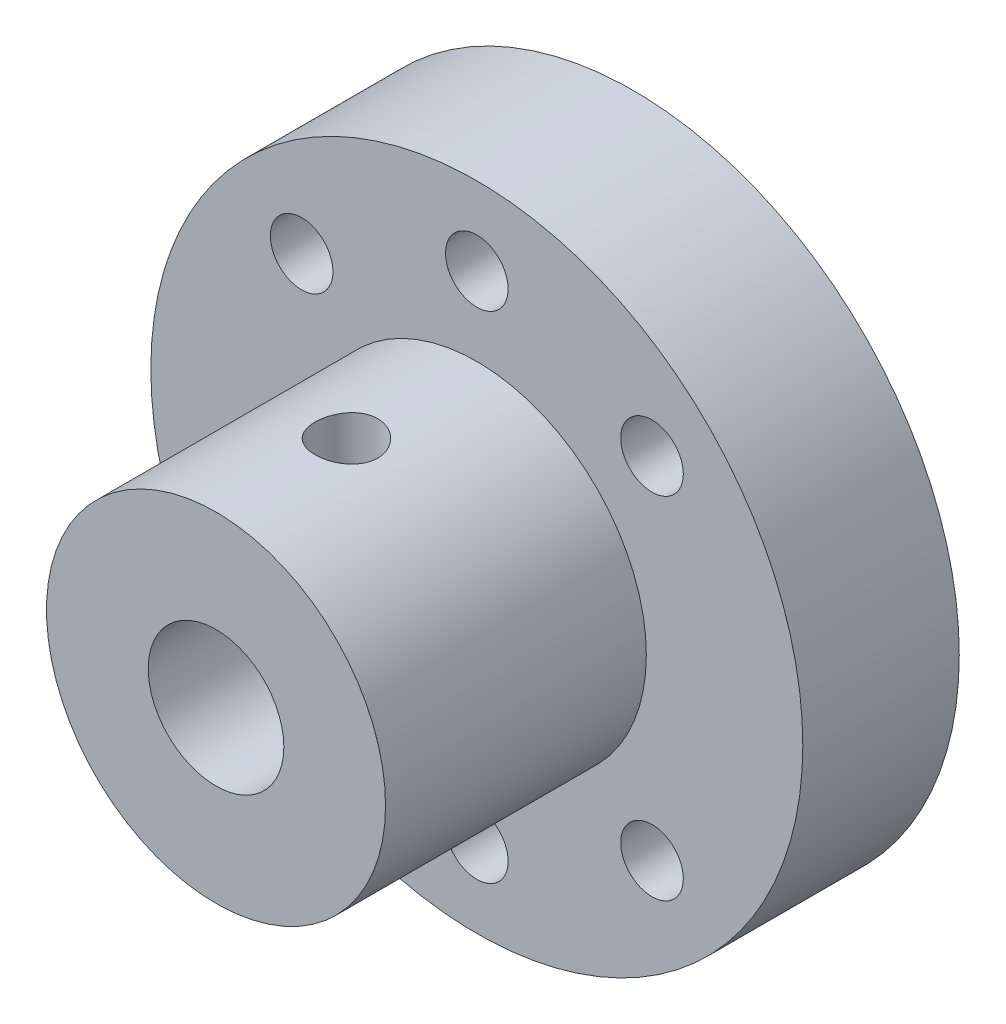
ISO-10303-21;
HEADER;
FILE_DESCRIPTION(('STEP AP214'),'2;1');
FILE_NAME('part.step','',(''),(''),'','','');
FILE_SCHEMA(('AUTOMOTIVE_DESIGN { 1 0 10303 214 1 1 1 1 }'));
ENDSEC;
DATA;
#1=APPLICATION_CONTEXT('core data for automotive mechanical design processes');
#2=APPLICATION_PROTOCOL_DEFINITION('international standard','automotive_design',2000,#1);
#3=PRODUCT_CONTEXT('',#1,'mechanical');
#4=PRODUCT('Part','Part','',(#3));
#5=PRODUCT_RELATED_PRODUCT_CATEGORY('part','',(#4));
#6=PRODUCT_DEFINITION_FORMATION('','',#4);
#7=PRODUCT_DEFINITION_CONTEXT('part definition',#1,'design');
#8=PRODUCT_DEFINITION('design','',#6,#7);
#9=PRODUCT_DEFINITION_SHAPE('','',#8);
#10=(LENGTH_UNIT() NAMED_UNIT(*) SI_UNIT(.MILLI.,.METRE.));
#11=(NAMED_UNIT(*) PLANE_ANGLE_UNIT() SI_UNIT($,.RADIAN.));
#12=(NAMED_UNIT(*) SI_UNIT($,.STERADIAN.) SOLID_ANGLE_UNIT());
#13=UNCERTAINTY_MEASURE_WITH_UNIT(LENGTH_MEASURE(1.E-05),#10,'distance_accuracy_value','');
#14=(GEOMETRIC_REPRESENTATION_CONTEXT(3) GLOBAL_UNCERTAINTY_ASSIGNED_CONTEXT((#13)) GLOBAL_UNIT_ASSIGNED_CONTEXT((#10,
#11,#12)) REPRESENTATION_CONTEXT('',''));
#15=CARTESIAN_POINT('',(0.,0.,0.));
#16=DIRECTION('',(0.,0.,1.));
#17=DIRECTION('',(1.,0.,0.));
#18=AXIS2_PLACEMENT_3D('',#15,#16,#17);
#19=CARTESIAN_POINT('',(0.,25.,11.));
#20=DIRECTION('',(0.,-1.,0.));
#21=DIRECTION('',(0.,0.,-1.));
#22=AXIS2_PLACEMENT_3D('',#19,#20,#21);
#23=CYLINDRICAL_SURFACE('',#22,1.2);
#24=CARTESIAN_POINT('',(0.,-6.5,9.8));
#25=CARTESIAN_POINT('',(0.0667962993626081,-6.49999879727572,9.80000257211707));
#26=CARTESIAN_POINT('',(0.133626281673587,-6.49895972178335,9.80559602783191));
#27=CARTESIAN_POINT('',(0.265404300030401,-6.49491478174011,9.82780839939203));
#28=CARTESIAN_POINT('',(0.330350677512255,-6.49190723570874,9.84443674147905));
#29=CARTESIAN_POINT('',(0.456436519782736,-6.48426191804226,9.88819343614065));
#30=CARTESIAN_POINT('',(0.517579319792998,-6.47962559903149,9.91531243477524));
#31=CARTESIAN_POINT('',(0.634441109694969,-6.46922952137734,9.97925437230046));
#32=CARTESIAN_POINT('',(0.690160564109867,-6.46346985907829,10.0160764790921));
#33=CARTESIAN_POINT('',(0.795247744205698,-6.45138834939994,10.0988339655751));
#34=CARTESIAN_POINT('',(0.844543292388614,-6.44506127279023,10.1448602438627));
#35=CARTESIAN_POINT('',(0.934759066401608,-6.43259702053078,10.2445239993348));
#36=CARTESIAN_POINT('',(0.975678701684754,-6.42645985829691,10.2981620127366));
#37=CARTESIAN_POINT('',(1.04827972317034,-6.41501951319584,10.4120346888511));
#38=CARTESIAN_POINT('',(1.07988798202191,-6.40972307507926,10.4723167120454));
#39=CARTESIAN_POINT('',(1.13250094978906,-6.40063738902812,10.5974493310561));
#40=CARTESIAN_POINT('',(1.15350654396689,-6.39684801526784,10.6622995449391));
#41=CARTESIAN_POINT('',(1.18408687284635,-6.39125806003697,10.7939563964509));
#42=CARTESIAN_POINT('',(1.19378730462821,-6.38943562620813,10.8607328919666));
#43=CARTESIAN_POINT('',(1.20187204389847,-6.38791998048299,10.9949886066854));
#44=CARTESIAN_POINT('',(1.20025733484479,-6.38822658354097,11.0624677643074));
#45=CARTESIAN_POINT('',(1.18585961873334,-6.39091446543458,11.1953046129655));
#46=CARTESIAN_POINT('',(1.17321929073711,-6.39326923845306,11.2606783838624));
#47=CARTESIAN_POINT('',(1.13735373323502,-6.39974652439446,11.3883611380003));
#48=CARTESIAN_POINT('',(1.11412806641468,-6.40386911035101,11.4506699945019));
#49=CARTESIAN_POINT('',(1.05761084900825,-6.41344535336497,11.5708730718194));
#50=CARTESIAN_POINT('',(1.0242614500129,-6.41890662438299,11.6287394617883));
#51=CARTESIAN_POINT('',(0.948484370023446,-6.43053982016241,11.7381087118248));
#52=CARTESIAN_POINT('',(0.906055794920213,-6.43671181488758,11.7896109443674));
#53=CARTESIAN_POINT('',(0.812554310960554,-6.44918666593044,11.8856145088169));
#54=CARTESIAN_POINT('',(0.761359307961523,-6.45549008145401,11.9299969416265));
#55=CARTESIAN_POINT('',(0.652187389345436,-6.46743086297198,12.0095611870548));
#56=CARTESIAN_POINT('',(0.594210409619175,-6.47306822266922,12.0447429126901));
#57=CARTESIAN_POINT('',(0.472998043002823,-6.48305257458405,12.1049236018053));
#58=CARTESIAN_POINT('',(0.409756516582691,-6.48739803241448,12.1299104698962));
#59=CARTESIAN_POINT('',(0.279875838888337,-6.49429705012122,12.1688733856488));
#60=CARTESIAN_POINT('',(0.213237038103507,-6.49685079444502,12.1828505667182));
#61=CARTESIAN_POINT('',(0.0794766430718829,-6.49985338930874,12.1992324791651));
#62=CARTESIAN_POINT('',(0.0123756497053713,-6.50033187707818,12.2018001653558));
#63=CARTESIAN_POINT('',(-0.121296981962713,-6.49921181273706,12.1957269238374));
#64=CARTESIAN_POINT('',(-0.187868645294989,-6.49761335943468,12.1870865293404));
#65=CARTESIAN_POINT('',(-0.318077984755796,-6.49253745576473,12.1589778880872));
#66=CARTESIAN_POINT('',(-0.381734009693139,-6.48907427500552,12.1395918384477));
#67=CARTESIAN_POINT('',(-0.504892375398316,-6.4806556240529,12.0906309426582));
#68=CARTESIAN_POINT('',(-0.564394440600634,-6.47570005497306,12.0610554213297));
#69=CARTESIAN_POINT('',(-0.678253095830679,-6.4647724074758,11.9921926389773));
#70=CARTESIAN_POINT('',(-0.732548265605505,-6.45879008348503,11.9528054836735));
#71=CARTESIAN_POINT('',(-0.833816870545852,-6.44649953986676,11.8655729863892));
#72=CARTESIAN_POINT('',(-0.880789643607566,-6.44019129083715,11.8177268803695));
#73=CARTESIAN_POINT('',(-0.966697085412809,-6.42786191143313,11.7141978916263));
#74=CARTESIAN_POINT('',(-1.00552070246097,-6.42184551244879,11.6584222026507));
#75=CARTESIAN_POINT('',(-1.07324774919417,-6.41087523291019,11.5410450642831));
#76=CARTESIAN_POINT('',(-1.10215154047974,-6.40592131362856,11.4794438273501));
#77=CARTESIAN_POINT('',(-1.14905975241548,-6.39767379439307,11.3524502912698));
#78=CARTESIAN_POINT('',(-1.16711570494917,-6.39437235713613,11.2870775593624));
#79=CARTESIAN_POINT('',(-1.19197513111159,-6.38978543443045,11.1541598228393));
#80=CARTESIAN_POINT('',(-1.19877983115992,-6.38849972926177,11.0866150558001));
#81=CARTESIAN_POINT('',(-1.20090353537778,-6.3881007482456,10.9523824427173));
#82=CARTESIAN_POINT('',(-1.19639765292492,-6.38895435075601,10.8856974024697));
#83=CARTESIAN_POINT('',(-1.17641079397786,-6.39266448585662,10.7540525811393));
#84=CARTESIAN_POINT('',(-1.16092987834811,-6.39552100733921,10.6890927904909));
#85=CARTESIAN_POINT('',(-1.11950532017773,-6.40290136886896,10.5628328037374));
#86=CARTESIAN_POINT('',(-1.09358007946632,-6.40742227523992,10.5015263877117));
#87=CARTESIAN_POINT('',(-1.032021760182,-6.41762418955728,10.3841052623261));
#88=CARTESIAN_POINT('',(-0.996388024820644,-6.42330527598439,10.3279909045579));
#89=CARTESIAN_POINT('',(-0.915813071798076,-6.43529057182139,10.2216684838111));
#90=CARTESIAN_POINT('',(-0.870744203302653,-6.44160263227606,10.1715580280314));
#91=CARTESIAN_POINT('',(-0.772845002820406,-6.45407937835197,10.0795524609866));
#92=CARTESIAN_POINT('',(-0.720012889705215,-6.46024402977463,10.0376592401731));
#93=CARTESIAN_POINT('',(-0.607537484977905,-6.47179409996219,9.96293825948846));
#94=CARTESIAN_POINT('',(-0.547839004017674,-6.47717228318667,9.93019242527087));
#95=CARTESIAN_POINT('',(-0.42370854944922,-6.48647285935735,9.87524717130095));
#96=CARTESIAN_POINT('',(-0.3592811283988,-6.49039663100581,9.85303775798059));
#97=CARTESIAN_POINT('',(-0.245545866371185,-6.49553807584249,9.82435080717887));
#98=CARTESIAN_POINT('',(-0.196906528350574,-6.49720192234607,9.81523471554345));
#99=CARTESIAN_POINT('',(-0.0988509306569767,-6.49943331626516,9.80305843317357));
#100=CARTESIAN_POINT('',(-0.0494346897454305,-6.50000089011371,9.79999809642434));
#101=CARTESIAN_POINT('',(0.,-6.5,9.8));
#102=B_SPLINE_CURVE_WITH_KNOTS('',3,(#24,#25,#26,#27,#28,#29,#30,#31,#32,#33,#34,#35,#36,#37,
#38,#39,#40,#41,#42,#43,#44,#45,#46,#47,#48,#49,#50,#51,#52,#53,#54,#55,#56,#57,#58,#59,#60,#61,
#62,#63,#64,#65,#66,#67,#68,#69,#70,#71,#72,#73,#74,#75,#76,#77,#78,#79,#80,#81,#82,#83,#84,#85,
#86,#87,#88,#89,#90,#91,#92,#93,#94,#95,#96,#97,#98,#99,#100,#101),.UNSPECIFIED.,.T.,.F.,(4,2,2,
2,2,2,2,2,2,2,2,2,2,2,2,2,2,2,2,2,2,2,2,2,2,2,2,2,2,2,2,2,2,2,2,2,2,2,4),(0.,0.200208125257265,
0.400587493204053,0.600788604213541,0.800972552376601,1.00324088953467,1.20552348279051,
1.40935476877731,1.61316903319364,1.81469487992138,2.01620321120369,2.21514193787252,
2.41408888408644,2.61419475105378,2.81432033334393,3.01750151628567,3.2206846200298,
3.42410808829514,3.6275106121083,3.8279985269071,4.02847690406412,4.22744250539259,
4.42642129319003,4.62751523490318,4.8286273493452,5.03232388047527,5.23601298560803,
5.43872666786995,5.64141825228765,5.84099112816951,6.04056289728494,6.23978456857919,
6.43901972074741,6.64114822168658,6.84332316977221,7.04725467103853,7.25099235904023,
7.39916621446434,7.54733649711547),.UNSPECIFIED.);
#103=CARTESIAN_POINT('',(0.,-6.5,9.8));
#104=VERTEX_POINT('',#103);
#105=EDGE_CURVE('E99',#104,#104,#102,.T.);
#106=ORIENTED_EDGE('',*,*,#105,.T.);
#107=EDGE_LOOP('',(#106));
#108=FACE_BOUND('',#107,.T.);
#109=CARTESIAN_POINT('',(0.,-2.6,9.8));
#110=CARTESIAN_POINT('',(-0.0636532268816322,-2.59999718597822,9.80000336998323));
#111=CARTESIAN_POINT('',(-0.127399042201598,-2.59763662818433,9.80509450777092));
#112=CARTESIAN_POINT('',(-0.253042141169717,-2.58842783188776,9.82525054494741));
#113=CARTESIAN_POINT('',(-0.31493491548471,-2.58156945057963,9.8403379872699));
#114=CARTESIAN_POINT('',(-0.434856989321515,-2.5640900937612,9.87979092873397));
#115=CARTESIAN_POINT('',(-0.492899567661716,-2.55348294499246,9.90412235728243));
#116=CARTESIAN_POINT('',(-0.604009204690612,-2.52950742914898,9.96121346683976));
#117=CARTESIAN_POINT('',(-0.657077164281334,-2.51613956344932,9.99397161773264));
#118=CARTESIAN_POINT('',(-0.759947590922261,-2.48706428400778,10.0690069633604));
#119=CARTESIAN_POINT('',(-0.809420678774752,-2.47126968566342,10.1117015287035));
#120=CARTESIAN_POINT('',(-0.900798998405768,-2.43944804820435,10.2045085021185));
#121=CARTESIAN_POINT('',(-0.942699360382197,-2.4234208666271,10.2546256460173));
#122=CARTESIAN_POINT('',(-1.02039109742659,-2.39179280818353,10.3646887546526));
#123=CARTESIAN_POINT('',(-1.05562627840835,-2.37628348098913,10.4250565585708));
#124=CARTESIAN_POINT('',(-1.11529754349039,-2.34887151636921,10.5516693975913));
#125=CARTESIAN_POINT('',(-1.1397403869729,-2.33696662291242,10.6179107227193));
#126=CARTESIAN_POINT('',(-1.1756996326278,-2.31907657116725,10.7506203785225));
#127=CARTESIAN_POINT('',(-1.18785433965664,-2.31280125877224,10.8168748956686));
#128=CARTESIAN_POINT('',(-1.2008701907043,-2.30607253349274,10.9507565834457));
#129=CARTESIAN_POINT('',(-1.20173982906868,-2.3056147417275,11.0183826832695));
#130=CARTESIAN_POINT('',(-1.19263424070564,-2.31033313881724,11.1459794524751));
#131=CARTESIAN_POINT('',(-1.18371468081801,-2.31496095946607,11.2060502310473));
#132=CARTESIAN_POINT('',(-1.15708487424509,-2.32838454262554,11.3237208928969));
#133=CARTESIAN_POINT('',(-1.13937243852228,-2.33718134300317,11.381320156995));
#134=CARTESIAN_POINT('',(-1.09531112381307,-2.35815565087355,11.4940034273013));
#135=CARTESIAN_POINT('',(-1.06877338468164,-2.37040610581246,11.5489993819035));
#136=CARTESIAN_POINT('',(-1.00795264685552,-2.39690015543958,11.6540006151551));
#137=CARTESIAN_POINT('',(-0.973666288228021,-2.41114461373865,11.7040037152159));
#138=CARTESIAN_POINT('',(-0.894072717956689,-2.44185123578383,11.8031763255307));
#139=CARTESIAN_POINT('',(-0.8479827944315,-2.45838848041605,11.8516964229271));
#140=CARTESIAN_POINT('',(-0.748200506273081,-2.49057089212119,11.9405644038916));
#141=CARTESIAN_POINT('',(-0.69450548771006,-2.50621574509379,11.9809094226272));
#142=CARTESIAN_POINT('',(-0.578678739002898,-2.53551070224549,12.0535455250453));
#143=CARTESIAN_POINT('',(-0.516321573143491,-2.54907447739207,12.0855146462066));
#144=CARTESIAN_POINT('',(-0.386327438683682,-2.57198252082471,12.1382714884394));
#145=CARTESIAN_POINT('',(-0.318694096087707,-2.58132965751049,12.1590668124154));
#146=CARTESIAN_POINT('',(-0.18544113578112,-2.59417744325976,12.1873932614617));
#147=CARTESIAN_POINT('',(-0.120042944256509,-2.59805959305261,12.1957921660551));
#148=CARTESIAN_POINT('',(0.0113403663383735,-2.60080410530082,12.2017448519472));
#149=CARTESIAN_POINT('',(0.0773252551716935,-2.59966835706424,12.1993027150462));
#150=CARTESIAN_POINT('',(0.203558183081119,-2.59274156066583,12.1842075931055));
#151=CARTESIAN_POINT('',(0.263903852738216,-2.58725177238727,12.1722151869456));
#152=CARTESIAN_POINT('',(0.381631745398545,-2.57252378400396,12.1393392233855));
#153=CARTESIAN_POINT('',(0.439013617481011,-2.56328514116749,12.118454615821));
#154=CARTESIAN_POINT('',(0.551204039940733,-2.54156276652182,12.0677458749764));
#155=CARTESIAN_POINT('',(0.605878726306149,-2.5289877752444,12.0376660021426));
#156=CARTESIAN_POINT('',(0.709599490549104,-2.50186871894127,11.969699700541));
#157=CARTESIAN_POINT('',(0.75864308036983,-2.4873237896527,11.9318098415005));
#158=CARTESIAN_POINT('',(0.854172844717282,-2.45624192721559,11.8455063851353));
#159=CARTESIAN_POINT('',(0.900074574176423,-2.43964133893412,11.7964673320545));
#160=CARTESIAN_POINT('',(0.983214371343814,-2.40733944891322,11.6912230757457));
#161=CARTESIAN_POINT('',(1.02044856200986,-2.3916385519692,11.6350146829632));
#162=CARTESIAN_POINT('',(1.08619631367942,-2.36252265347181,11.5147902219522));
#163=CARTESIAN_POINT('',(1.11441210555748,-2.3491911376163,11.4505894465175));
#164=CARTESIAN_POINT('',(1.15934971460282,-2.32734680846429,11.317529821525));
#165=CARTESIAN_POINT('',(1.17608391029098,-2.31882880738234,11.2486760767064));
#166=CARTESIAN_POINT('',(1.19623248787429,-2.30849396257735,11.1148542646116));
#167=CARTESIAN_POINT('',(1.20069963826376,-2.30614825882008,11.0500856465171));
#168=CARTESIAN_POINT('',(1.19912279692617,-2.30696915555751,10.9207204973381));
#169=CARTESIAN_POINT('',(1.19308157282212,-2.3101343046421,10.8561239254288));
#170=CARTESIAN_POINT('',(1.17160210977776,-2.32109371486401,10.7336439270177));
#171=CARTESIAN_POINT('',(1.15684931286442,-2.3285493950618,10.6756066619525));
#172=CARTESIAN_POINT('',(1.11912456106886,-2.34691239221386,10.5628534989654));
#173=CARTESIAN_POINT('',(1.09615017725399,-2.35782072908861,10.5081385881719));
#174=CARTESIAN_POINT('',(1.04091314221659,-2.38274502449082,10.399627199603));
#175=CARTESIAN_POINT('',(1.00813857779348,-2.39691829300039,10.3461283306333));
#176=CARTESIAN_POINT('',(0.934865150648366,-2.42643495037208,10.245064899699));
#177=CARTESIAN_POINT('',(0.894362763164965,-2.44177887126006,10.1975030621317));
#178=CARTESIAN_POINT('',(0.802136655866581,-2.47369766102857,10.1048732586845));
#179=CARTESIAN_POINT('',(0.749704577671707,-2.49024705125136,10.0604981247793));
#180=CARTESIAN_POINT('',(0.637586889641826,-2.52128189557285,9.98107843211604));
#181=CARTESIAN_POINT('',(0.577897891218337,-2.53576637856047,9.94603825683664));
#182=CARTESIAN_POINT('',(0.453162323094288,-2.5609889649644,9.88672501191485));
#183=CARTESIAN_POINT('',(0.388155383083038,-2.57175212585332,9.86237961598988));
#184=CARTESIAN_POINT('',(0.25443770332102,-2.58839073084898,9.82524622243439));
#185=CARTESIAN_POINT('',(0.185738713963877,-2.59428080476211,9.81242362142129));
#186=CARTESIAN_POINT('',(0.0971050820999139,-2.59825919402017,9.80377627120412));
#187=CARTESIAN_POINT('',(0.0777195101198888,-2.59891073566895,9.80236165451141));
#188=CARTESIAN_POINT('',(0.0388921744880321,-2.59978157249948,9.80047299553705));
#189=CARTESIAN_POINT('',(0.0194504098278651,-2.60000085987592,9.79999897023987));
#190=CARTESIAN_POINT('',(0.,-2.6,9.8));
#191=B_SPLINE_CURVE_WITH_KNOTS('',3,(#109,#110,#111,#112,#113,#114,#115,#116,#117,#118,#119,
#120,#121,#122,#123,#124,#125,#126,#127,#128,#129,#130,#131,#132,#133,#134,#135,#136,#137,#138,
#139,#140,#141,#142,#143,#144,#145,#146,#147,#148,#149,#150,#151,#152,#153,#154,#155,#156,#157,
#158,#159,#160,#161,#162,#163,#164,#165,#166,#167,#168,#169,#170,#171,#172,#173,#174,#175,#176,
#177,#178,#179,#180,#181,#182,#183,#184,#185,#186,#187,#188,#189,#190),.UNSPECIFIED.,.T.,.F.,(4,
2,2,2,2,2,2,2,2,2,2,2,2,2,2,2,2,2,2,2,2,2,2,2,2,2,2,2,2,2,2,2,2,2,2,2,2,2,2,2,4),(0.,
0.190880081987129,0.382192094596242,0.572805722923842,0.763384764216795,0.96421894679049,
1.16518182404142,1.37889389795316,1.59247193066903,1.79427624780732,1.99592865668771,
2.17779604297189,2.35970872892187,2.54579591471168,2.73196394640952,2.93785304538013,
3.14381417076135,3.35680637948641,3.56965347937843,3.76674772078538,3.96376775980774,
4.14823315806289,4.33272034763108,4.52289490507747,4.71315316894576,4.9198044450045,
5.12654798055856,5.33954359505247,5.55230921267747,5.74614164004694,5.9399230249013,
6.12017662775601,6.30048352759663,6.49266083934946,6.68492601614632,6.89589690175407,
7.10696668044021,7.31658620341955,7.52557410689609,7.58389996035809,7.64222686701328),.UNSPECIFIED.);
#192=CARTESIAN_POINT('',(0.,-2.6,9.8));
#193=VERTEX_POINT('',#192);
#194=EDGE_CURVE('E66',#193,#193,#191,.T.);
#195=ORIENTED_EDGE('',*,*,#194,.T.);
#196=EDGE_LOOP('',(#195));
#197=FACE_BOUND('',#196,.T.);
#198=ADVANCED_FACE('F31',(#108,#197),#23,.F.);
#199=CARTESIAN_POINT('',(0.,6.5,9.8));
#200=CARTESIAN_POINT('',(-0.0667962993626081,6.49999879727572,9.80000257211707));
#201=CARTESIAN_POINT('',(-0.133626281673587,6.49895972178335,9.80559602783191));
#202=CARTESIAN_POINT('',(-0.265404300030401,6.49491478174011,9.82780839939203));
#203=CARTESIAN_POINT('',(-0.330350677512255,6.49190723570874,9.84443674147905));
#204=CARTESIAN_POINT('',(-0.456436519782736,6.48426191804226,9.88819343614065));
#205=CARTESIAN_POINT('',(-0.517579319792998,6.47962559903149,9.91531243477524));
#206=CARTESIAN_POINT('',(-0.634441109694969,6.46922952137734,9.97925437230046));
#207=CARTESIAN_POINT('',(-0.690160564109867,6.46346985907829,10.0160764790921));
#208=CARTESIAN_POINT('',(-0.795247744205698,6.45138834939994,10.0988339655751));
#209=CARTESIAN_POINT('',(-0.844543292388614,6.44506127279023,10.1448602438627));
#210=CARTESIAN_POINT('',(-0.934759066401608,6.43259702053078,10.2445239993348));
#211=CARTESIAN_POINT('',(-0.975678701684754,6.42645985829691,10.2981620127366));
#212=CARTESIAN_POINT('',(-1.04827972317034,6.41501951319584,10.4120346888511));
#213=CARTESIAN_POINT('',(-1.07988798202191,6.40972307507926,10.4723167120454));
#214=CARTESIAN_POINT('',(-1.13250094978906,6.40063738902812,10.5974493310561));
#215=CARTESIAN_POINT('',(-1.15350654396689,6.39684801526784,10.6622995449391));
#216=CARTESIAN_POINT('',(-1.18408687284635,6.39125806003697,10.7939563964509));
#217=CARTESIAN_POINT('',(-1.19378730462821,6.38943562620813,10.8607328919666));
#218=CARTESIAN_POINT('',(-1.20187204389847,6.38791998048299,10.9949886066854));
#219=CARTESIAN_POINT('',(-1.20025733484479,6.38822658354097,11.0624677643074));
#220=CARTESIAN_POINT('',(-1.18585961873334,6.39091446543458,11.1953046129655));
#221=CARTESIAN_POINT('',(-1.17321929073711,6.39326923845306,11.2606783838624));
#222=CARTESIAN_POINT('',(-1.13735373323502,6.39974652439446,11.3883611380003));
#223=CARTESIAN_POINT('',(-1.11412806641468,6.40386911035101,11.4506699945019));
#224=CARTESIAN_POINT('',(-1.05761084900825,6.41344535336497,11.5708730718194));
#225=CARTESIAN_POINT('',(-1.0242614500129,6.41890662438299,11.6287394617883));
#226=CARTESIAN_POINT('',(-0.948484370023446,6.43053982016241,11.7381087118248));
#227=CARTESIAN_POINT('',(-0.906055794920213,6.43671181488758,11.7896109443674));
#228=CARTESIAN_POINT('',(-0.812554310960554,6.44918666593044,11.8856145088169));
#229=CARTESIAN_POINT('',(-0.761359307961523,6.45549008145401,11.9299969416265));
#230=CARTESIAN_POINT('',(-0.652187389345436,6.46743086297198,12.0095611870548));
#231=CARTESIAN_POINT('',(-0.594210409619175,6.47306822266922,12.0447429126901));
#232=CARTESIAN_POINT('',(-0.472998043002823,6.48305257458405,12.1049236018053));
#233=CARTESIAN_POINT('',(-0.409756516582691,6.48739803241448,12.1299104698962));
#234=CARTESIAN_POINT('',(-0.279875838888337,6.49429705012122,12.1688733856488));
#235=CARTESIAN_POINT('',(-0.213237038103507,6.49685079444502,12.1828505667182));
#236=CARTESIAN_POINT('',(-0.0794766430718829,6.49985338930874,12.1992324791651));
#237=CARTESIAN_POINT('',(-0.0123756497053713,6.50033187707818,12.2018001653558));
#238=CARTESIAN_POINT('',(0.121296981962713,6.49921181273706,12.1957269238374));
#239=CARTESIAN_POINT('',(0.187868645294989,6.49761335943468,12.1870865293404));
#240=CARTESIAN_POINT('',(0.318077984755796,6.49253745576473,12.1589778880872));
#241=CARTESIAN_POINT('',(0.381734009693139,6.48907427500552,12.1395918384477));
#242=CARTESIAN_POINT('',(0.504892375398316,6.4806556240529,12.0906309426582));
#243=CARTESIAN_POINT('',(0.564394440600634,6.47570005497306,12.0610554213297));
#244=CARTESIAN_POINT('',(0.678253095830679,6.4647724074758,11.9921926389773));
#245=CARTESIAN_POINT('',(0.732548265605505,6.45879008348503,11.9528054836735));
#246=CARTESIAN_POINT('',(0.833816870545852,6.44649953986676,11.8655729863892));
#247=CARTESIAN_POINT('',(0.880789643607566,6.44019129083715,11.8177268803695));
#248=CARTESIAN_POINT('',(0.966697085412809,6.42786191143313,11.7141978916263));
#249=CARTESIAN_POINT('',(1.00552070246097,6.42184551244879,11.6584222026507));
#250=CARTESIAN_POINT('',(1.07324774919417,6.41087523291019,11.5410450642831));
#251=CARTESIAN_POINT('',(1.10215154047974,6.40592131362856,11.4794438273501));
#252=CARTESIAN_POINT('',(1.14905975241548,6.39767379439307,11.3524502912698));
#253=CARTESIAN_POINT('',(1.16711570494917,6.39437235713613,11.2870775593624));
#254=CARTESIAN_POINT('',(1.19197513111159,6.38978543443045,11.1541598228393));
#255=CARTESIAN_POINT('',(1.19877983115992,6.38849972926177,11.0866150558001));
#256=CARTESIAN_POINT('',(1.20090353537778,6.3881007482456,10.9523824427173));
#257=CARTESIAN_POINT('',(1.19639765292492,6.38895435075601,10.8856974024697));
#258=CARTESIAN_POINT('',(1.17641079397786,6.39266448585662,10.7540525811393));
#259=CARTESIAN_POINT('',(1.16092987834811,6.39552100733921,10.6890927904909));
#260=CARTESIAN_POINT('',(1.11950532017773,6.40290136886896,10.5628328037374));
#261=CARTESIAN_POINT('',(1.09358007946632,6.40742227523992,10.5015263877117));
#262=CARTESIAN_POINT('',(1.032021760182,6.41762418955728,10.3841052623261));
#263=CARTESIAN_POINT('',(0.996388024820644,6.42330527598439,10.3279909045579));
#264=CARTESIAN_POINT('',(0.915813071798076,6.43529057182139,10.2216684838111));
#265=CARTESIAN_POINT('',(0.870744203302653,6.44160263227606,10.1715580280314));
#266=CARTESIAN_POINT('',(0.772845002820406,6.45407937835197,10.0795524609866));
#267=CARTESIAN_POINT('',(0.720012889705215,6.46024402977463,10.0376592401731));
#268=CARTESIAN_POINT('',(0.607537484977905,6.47179409996219,9.96293825948846));
#269=CARTESIAN_POINT('',(0.547839004017674,6.47717228318667,9.93019242527087));
#270=CARTESIAN_POINT('',(0.42370854944922,6.48647285935735,9.87524717130095));
#271=CARTESIAN_POINT('',(0.3592811283988,6.49039663100581,9.85303775798059));
#272=CARTESIAN_POINT('',(0.245545866371185,6.49553807584249,9.82435080717887));
#273=CARTESIAN_POINT('',(0.196906528350574,6.49720192234607,9.81523471554345));
#274=CARTESIAN_POINT('',(0.0988509306569767,6.49943331626516,9.80305843317357));
#275=CARTESIAN_POINT('',(0.0494346897454305,6.50000089011371,9.79999809642434));
#276=CARTESIAN_POINT('',(0.,6.5,9.8));
#277=B_SPLINE_CURVE_WITH_KNOTS('',3,(#199,#200,#201,#202,#203,#204,#205,#206,#207,#208,#209,
#210,#211,#212,#213,#214,#215,#216,#217,#218,#219,#220,#221,#222,#223,#224,#225,#226,#227,#228,
#229,#230,#231,#232,#233,#234,#235,#236,#237,#238,#239,#240,#241,#242,#243,#244,#245,#246,#247,
#248,#249,#250,#251,#252,#253,#254,#255,#256,#257,#258,#259,#260,#261,#262,#263,#264,#265,#266,
#267,#268,#269,#270,#271,#272,#273,#274,#275,#276),.UNSPECIFIED.,.T.,.F.,(4,2,2,2,2,2,2,2,2,2,2,
2,2,2,2,2,2,2,2,2,2,2,2,2,2,2,2,2,2,2,2,2,2,2,2,2,2,2,4),(0.,0.200208125257265,
0.400587493204053,0.600788604213541,0.800972552376601,1.00324088953467,1.20552348279051,
1.40935476877731,1.61316903319364,1.81469487992138,2.01620321120369,2.21514193787252,
2.41408888408644,2.61419475105378,2.81432033334393,3.01750151628567,3.2206846200298,
3.42410808829514,3.6275106121083,3.8279985269071,4.02847690406412,4.22744250539259,
4.42642129319003,4.62751523490318,4.8286273493452,5.03232388047527,5.23601298560803,
5.43872666786995,5.64141825228765,5.84099112816951,6.04056289728494,6.23978456857919,
6.43901972074741,6.64114822168658,6.84332316977221,7.04725467103853,7.25099235904023,
7.39916621446434,7.54733649711547),.UNSPECIFIED.);
#278=CARTESIAN_POINT('',(0.,6.5,9.8));
#279=VERTEX_POINT('',#278);
#280=EDGE_CURVE('E105',#279,#279,#277,.T.);
#281=ORIENTED_EDGE('',*,*,#280,.T.);
#282=EDGE_LOOP('',(#281));
#283=FACE_BOUND('',#282,.T.);
#284=CARTESIAN_POINT('',(0.,2.6,9.8));
#285=CARTESIAN_POINT('',(0.0636532268816322,2.59999718597822,9.80000336998323));
#286=CARTESIAN_POINT('',(0.127399042201598,2.59763662818433,9.80509450777092));
#287=CARTESIAN_POINT('',(0.253042141169717,2.58842783188776,9.82525054494741));
#288=CARTESIAN_POINT('',(0.31493491548471,2.58156945057963,9.8403379872699));
#289=CARTESIAN_POINT('',(0.434856989321515,2.5640900937612,9.87979092873397));
#290=CARTESIAN_POINT('',(0.492899567661716,2.55348294499246,9.90412235728243));
#291=CARTESIAN_POINT('',(0.604009204690612,2.52950742914898,9.96121346683976));
#292=CARTESIAN_POINT('',(0.657077164281334,2.51613956344932,9.99397161773264));
#293=CARTESIAN_POINT('',(0.759947590922261,2.48706428400778,10.0690069633604));
#294=CARTESIAN_POINT('',(0.809420678774752,2.47126968566342,10.1117015287035));
#295=CARTESIAN_POINT('',(0.900798998405768,2.43944804820435,10.2045085021185));
#296=CARTESIAN_POINT('',(0.942699360382197,2.4234208666271,10.2546256460173));
#297=CARTESIAN_POINT('',(1.02039109742659,2.39179280818353,10.3646887546526));
#298=CARTESIAN_POINT('',(1.05562627840835,2.37628348098913,10.4250565585708));
#299=CARTESIAN_POINT('',(1.11529754349039,2.34887151636921,10.5516693975913));
#300=CARTESIAN_POINT('',(1.1397403869729,2.33696662291242,10.6179107227193));
#301=CARTESIAN_POINT('',(1.1756996326278,2.31907657116725,10.7506203785225));
#302=CARTESIAN_POINT('',(1.18785433965664,2.31280125877224,10.8168748956686));
#303=CARTESIAN_POINT('',(1.2008701907043,2.30607253349274,10.9507565834457));
#304=CARTESIAN_POINT('',(1.20173982906868,2.3056147417275,11.0183826832695));
#305=CARTESIAN_POINT('',(1.19263424070564,2.31033313881724,11.1459794524751));
#306=CARTESIAN_POINT('',(1.18371468081801,2.31496095946607,11.2060502310473));
#307=CARTESIAN_POINT('',(1.15708487424509,2.32838454262554,11.3237208928969));
#308=CARTESIAN_POINT('',(1.13937243852228,2.33718134300317,11.381320156995));
#309=CARTESIAN_POINT('',(1.09531112381307,2.35815565087355,11.4940034273013));
#310=CARTESIAN_POINT('',(1.06877338468164,2.37040610581246,11.5489993819035));
#311=CARTESIAN_POINT('',(1.00795264685552,2.39690015543958,11.6540006151551));
#312=CARTESIAN_POINT('',(0.973666288228021,2.41114461373865,11.7040037152159));
#313=CARTESIAN_POINT('',(0.894072717956689,2.44185123578383,11.8031763255307));
#314=CARTESIAN_POINT('',(0.8479827944315,2.45838848041605,11.8516964229271));
#315=CARTESIAN_POINT('',(0.748200506273081,2.49057089212119,11.9405644038916));
#316=CARTESIAN_POINT('',(0.69450548771006,2.50621574509379,11.9809094226272));
#317=CARTESIAN_POINT('',(0.578678739002898,2.53551070224549,12.0535455250453));
#318=CARTESIAN_POINT('',(0.516321573143491,2.54907447739207,12.0855146462066));
#319=CARTESIAN_POINT('',(0.386327438683682,2.57198252082471,12.1382714884394));
#320=CARTESIAN_POINT('',(0.318694096087707,2.58132965751049,12.1590668124154));
#321=CARTESIAN_POINT('',(0.18544113578112,2.59417744325976,12.1873932614617));
#322=CARTESIAN_POINT('',(0.120042944256509,2.59805959305261,12.1957921660551));
#323=CARTESIAN_POINT('',(-0.0113403663383735,2.60080410530082,12.2017448519472));
#324=CARTESIAN_POINT('',(-0.0773252551716935,2.59966835706424,12.1993027150462));
#325=CARTESIAN_POINT('',(-0.203558183081119,2.59274156066583,12.1842075931055));
#326=CARTESIAN_POINT('',(-0.263903852738216,2.58725177238727,12.1722151869456));
#327=CARTESIAN_POINT('',(-0.381631745398545,2.57252378400396,12.1393392233855));
#328=CARTESIAN_POINT('',(-0.439013617481011,2.56328514116749,12.118454615821));
#329=CARTESIAN_POINT('',(-0.551204039940733,2.54156276652182,12.0677458749764));
#330=CARTESIAN_POINT('',(-0.605878726306149,2.5289877752444,12.0376660021426));
#331=CARTESIAN_POINT('',(-0.709599490549104,2.50186871894127,11.969699700541));
#332=CARTESIAN_POINT('',(-0.75864308036983,2.4873237896527,11.9318098415005));
#333=CARTESIAN_POINT('',(-0.854172844717282,2.45624192721559,11.8455063851353));
#334=CARTESIAN_POINT('',(-0.900074574176423,2.43964133893412,11.7964673320545));
#335=CARTESIAN_POINT('',(-0.983214371343814,2.40733944891322,11.6912230757457));
#336=CARTESIAN_POINT('',(-1.02044856200986,2.3916385519692,11.6350146829632));
#337=CARTESIAN_POINT('',(-1.08619631367942,2.36252265347181,11.5147902219522));
#338=CARTESIAN_POINT('',(-1.11441210555748,2.3491911376163,11.4505894465175));
#339=CARTESIAN_POINT('',(-1.15934971460282,2.32734680846429,11.317529821525));
#340=CARTESIAN_POINT('',(-1.17608391029098,2.31882880738234,11.2486760767064));
#341=CARTESIAN_POINT('',(-1.19623248787429,2.30849396257735,11.1148542646116));
#342=CARTESIAN_POINT('',(-1.20069963826376,2.30614825882008,11.0500856465171));
#343=CARTESIAN_POINT('',(-1.19912279692617,2.30696915555751,10.9207204973381));
#344=CARTESIAN_POINT('',(-1.19308157282212,2.3101343046421,10.8561239254288));
#345=CARTESIAN_POINT('',(-1.17160210977776,2.32109371486401,10.7336439270177));
#346=CARTESIAN_POINT('',(-1.15684931286442,2.3285493950618,10.6756066619525));
#347=CARTESIAN_POINT('',(-1.11912456106886,2.34691239221386,10.5628534989654));
#348=CARTESIAN_POINT('',(-1.09615017725399,2.35782072908861,10.5081385881719));
#349=CARTESIAN_POINT('',(-1.04091314221659,2.38274502449082,10.399627199603));
#350=CARTESIAN_POINT('',(-1.00813857779348,2.39691829300039,10.3461283306333));
#351=CARTESIAN_POINT('',(-0.934865150648366,2.42643495037208,10.245064899699));
#352=CARTESIAN_POINT('',(-0.894362763164965,2.44177887126006,10.1975030621317));
#353=CARTESIAN_POINT('',(-0.802136655866581,2.47369766102857,10.1048732586845));
#354=CARTESIAN_POINT('',(-0.749704577671707,2.49024705125136,10.0604981247793));
#355=CARTESIAN_POINT('',(-0.637586889641826,2.52128189557285,9.98107843211604));
#356=CARTESIAN_POINT('',(-0.577897891218337,2.53576637856047,9.94603825683664));
#357=CARTESIAN_POINT('',(-0.453162323094288,2.5609889649644,9.88672501191485));
#358=CARTESIAN_POINT('',(-0.388155383083038,2.57175212585332,9.86237961598988));
#359=CARTESIAN_POINT('',(-0.25443770332102,2.58839073084898,9.82524622243439));
#360=CARTESIAN_POINT('',(-0.185738713963877,2.59428080476211,9.81242362142129));
#361=CARTESIAN_POINT('',(-0.0971050820999139,2.59825919402017,9.80377627120412));
#362=CARTESIAN_POINT('',(-0.0777195101198888,2.59891073566895,9.80236165451141));
#363=CARTESIAN_POINT('',(-0.0388921744880321,2.59978157249948,9.80047299553705));
#364=CARTESIAN_POINT('',(-0.0194504098278651,2.60000085987592,9.79999897023987));
#365=CARTESIAN_POINT('',(0.,2.6,9.8));
#366=B_SPLINE_CURVE_WITH_KNOTS('',3,(#284,#285,#286,#287,#288,#289,#290,#291,#292,#293,#294,
#295,#296,#297,#298,#299,#300,#301,#302,#303,#304,#305,#306,#307,#308,#309,#310,#311,#312,#313,
#314,#315,#316,#317,#318,#319,#320,#321,#322,#323,#324,#325,#326,#327,#328,#329,#330,#331,#332,
#333,#334,#335,#336,#337,#338,#339,#340,#341,#342,#343,#344,#345,#346,#347,#348,#349,#350,#351,
#352,#353,#354,#355,#356,#357,#358,#359,#360,#361,#362,#363,#364,#365),.UNSPECIFIED.,.T.,.F.,(4,
2,2,2,2,2,2,2,2,2,2,2,2,2,2,2,2,2,2,2,2,2,2,2,2,2,2,2,2,2,2,2,2,2,2,2,2,2,2,2,4),(0.,
0.190880081987129,0.382192094596242,0.572805722923842,0.763384764216795,0.96421894679049,
1.16518182404142,1.37889389795316,1.59247193066903,1.79427624780732,1.99592865668771,
2.17779604297189,2.35970872892187,2.54579591471168,2.73196394640952,2.93785304538013,
3.14381417076135,3.35680637948641,3.56965347937843,3.76674772078538,3.96376775980774,
4.14823315806289,4.33272034763108,4.52289490507747,4.71315316894576,4.9198044450045,
5.12654798055856,5.33954359505247,5.55230921267747,5.74614164004694,5.9399230249013,
6.12017662775601,6.30048352759663,6.49266083934946,6.68492601614632,6.89589690175407,
7.10696668044021,7.31658620341955,7.52557410689609,7.58389996035809,7.64222686701328),.UNSPECIFIED.);
#367=CARTESIAN_POINT('',(0.,2.6,9.8));
#368=VERTEX_POINT('',#367);
#369=EDGE_CURVE('E59',#368,#368,#366,.T.);
#370=ORIENTED_EDGE('',*,*,#369,.T.);
#371=EDGE_LOOP('',(#370));
#372=FACE_BOUND('',#371,.T.);
#373=ADVANCED_FACE('F112',(#283,#372),#23,.F.);
#374=CARTESIAN_POINT('',(0.,0.,16.));
#375=DIRECTION('',(0.,0.,-1.));
#376=DIRECTION('',(-1.,0.,0.));
#377=AXIS2_PLACEMENT_3D('',#374,#375,#376);
#378=CYLINDRICAL_SURFACE('',#377,6.5);
#379=CARTESIAN_POINT('',(0.,0.,16.));
#380=DIRECTION('',(0.,0.,1.));
#381=DIRECTION('',(1.,0.,0.));
#382=AXIS2_PLACEMENT_3D('',#379,#380,#381);
#383=CIRCLE('',#382,6.5);
#384=CARTESIAN_POINT('',(6.5,0.,16.));
#385=VERTEX_POINT('',#384);
#386=EDGE_CURVE('E44',#385,#385,#383,.T.);
#387=ORIENTED_EDGE('',*,*,#386,.F.);
#388=EDGE_LOOP('',(#387));
#389=FACE_BOUND('',#388,.T.);
#390=CARTESIAN_POINT('',(0.,0.,6.));
#391=DIRECTION('',(0.,0.,1.));
#392=DIRECTION('',(1.,0.,0.));
#393=AXIS2_PLACEMENT_3D('',#390,#391,#392);
#394=CIRCLE('',#393,6.5);
#395=CARTESIAN_POINT('',(6.5,0.,6.));
#396=VERTEX_POINT('',#395);
#397=EDGE_CURVE('E47',#396,#396,#394,.T.);
#398=ORIENTED_EDGE('',*,*,#397,.T.);
#399=EDGE_LOOP('',(#398));
#400=FACE_BOUND('',#399,.T.);
#401=ORIENTED_EDGE('',*,*,#105,.F.);
#402=EDGE_LOOP('',(#401));
#403=FACE_BOUND('',#402,.T.);
#404=ORIENTED_EDGE('',*,*,#280,.F.);
#405=EDGE_LOOP('',(#404));
#406=FACE_BOUND('',#405,.T.);
#407=ADVANCED_FACE('F108',(#389,#400,#403,#406),#378,.T.);
#408=CARTESIAN_POINT('',(0.,0.,6.));
#409=DIRECTION('',(0.,0.,-1.));
#410=DIRECTION('',(-1.,0.,0.));
#411=AXIS2_PLACEMENT_3D('',#408,#409,#410);
#412=CYLINDRICAL_SURFACE('',#411,12.5);
#413=CARTESIAN_POINT('',(0.,0.,6.));
#414=DIRECTION('',(0.,0.,1.));
#415=DIRECTION('',(1.,0.,0.));
#416=AXIS2_PLACEMENT_3D('',#413,#414,#415);
#417=CIRCLE('',#416,12.5);
#418=CARTESIAN_POINT('',(12.5,0.,6.));
#419=VERTEX_POINT('',#418);
#420=EDGE_CURVE('E10',#419,#419,#417,.T.);
#421=ORIENTED_EDGE('',*,*,#420,.F.);
#422=EDGE_LOOP('',(#421));
#423=FACE_BOUND('',#422,.T.);
#424=CARTESIAN_POINT('',(0.,0.,0.));
#425=DIRECTION('',(0.,0.,1.));
#426=DIRECTION('',(1.,0.,0.));
#427=AXIS2_PLACEMENT_3D('',#424,#425,#426);
#428=CIRCLE('',#427,12.5);
#429=CARTESIAN_POINT('',(12.5,0.,0.));
#430=VERTEX_POINT('',#429);
#431=EDGE_CURVE('E39',#430,#430,#428,.T.);
#432=ORIENTED_EDGE('',*,*,#431,.T.);
#433=EDGE_LOOP('',(#432));
#434=FACE_BOUND('',#433,.T.);
#435=ADVANCED_FACE('F33',(#423,#434),#412,.T.);
#436=CARTESIAN_POINT('',(0.,0.,6.));
#437=DIRECTION('',(0.,0.,1.));
#438=DIRECTION('',(1.,0.,0.));
#439=AXIS2_PLACEMENT_3D('',#436,#437,#438);
#440=PLANE('',#439);
#441=CARTESIAN_POINT('',(6.71751442127212,-6.71751442127228,6.));
#442=DIRECTION('',(0.,0.,1.));
#443=DIRECTION('',(1.,0.,0.));
#444=AXIS2_PLACEMENT_3D('',#441,#442,#443);
#445=CIRCLE('',#444,1.2);
#446=CARTESIAN_POINT('',(7.91751442127212,-6.71751442127228,6.));
#447=VERTEX_POINT('',#446);
#448=EDGE_CURVE('E207',#447,#447,#445,.T.);
#449=ORIENTED_EDGE('',*,*,#448,.F.);
#450=EDGE_LOOP('',(#449));
#451=FACE_BOUND('',#450,.T.);
#452=CARTESIAN_POINT('',(-6.71751442127221,-6.71751442127219,6.));
#453=DIRECTION('',(0.,0.,1.));
#454=DIRECTION('',(1.,0.,0.));
#455=AXIS2_PLACEMENT_3D('',#452,#453,#454);
#456=CIRCLE('',#455,1.2);
#457=CARTESIAN_POINT('',(-5.51751442127221,-6.71751442127219,6.));
#458=VERTEX_POINT('',#457);
#459=EDGE_CURVE('E212',#458,#458,#456,.T.);
#460=ORIENTED_EDGE('',*,*,#459,.F.);
#461=EDGE_LOOP('',(#460));
#462=FACE_BOUND('',#461,.T.);
#463=CARTESIAN_POINT('',(0.,-9.5,6.));
#464=DIRECTION('',(0.,0.,1.));
#465=DIRECTION('',(1.,0.,0.));
#466=AXIS2_PLACEMENT_3D('',#463,#464,#465);
#467=CIRCLE('',#466,1.2);
#468=CARTESIAN_POINT('',(1.2,-9.5,6.));
#469=VERTEX_POINT('',#468);
#470=EDGE_CURVE('E216',#469,#469,#467,.T.);
#471=ORIENTED_EDGE('',*,*,#470,.F.);
#472=EDGE_LOOP('',(#471));
#473=FACE_BOUND('',#472,.T.);
#474=CARTESIAN_POINT('',(6.71751442127212,6.71751442127228,6.));
#475=DIRECTION('',(0.,0.,1.));
#476=DIRECTION('',(1.,0.,0.));
#477=AXIS2_PLACEMENT_3D('',#474,#475,#476);
#478=CIRCLE('',#477,1.2);
#479=CARTESIAN_POINT('',(7.91751442127212,6.71751442127228,6.));
#480=VERTEX_POINT('',#479);
#481=EDGE_CURVE('E67',#480,#480,#478,.F.);
#482=ORIENTED_EDGE('',*,*,#481,.T.);
#483=EDGE_LOOP('',(#482));
#484=FACE_BOUND('',#483,.T.);
#485=CARTESIAN_POINT('',(-6.71751442127221,6.71751442127219,6.));
#486=DIRECTION('',(0.,0.,1.));
#487=DIRECTION('',(1.,0.,0.));
#488=AXIS2_PLACEMENT_3D('',#485,#486,#487);
#489=CIRCLE('',#488,1.2);
#490=CARTESIAN_POINT('',(-5.51751442127221,6.71751442127219,6.));
#491=VERTEX_POINT('',#490);
#492=EDGE_CURVE('E54',#491,#491,#489,.F.);
#493=ORIENTED_EDGE('',*,*,#492,.T.);
#494=EDGE_LOOP('',(#493));
#495=FACE_BOUND('',#494,.T.);
#496=CARTESIAN_POINT('',(0.,9.5,6.));
#497=DIRECTION('',(0.,0.,1.));
#498=DIRECTION('',(1.,0.,0.));
#499=AXIS2_PLACEMENT_3D('',#496,#497,#498);
#500=CIRCLE('',#499,1.2);
#501=CARTESIAN_POINT('',(1.2,9.5,6.));
#502=VERTEX_POINT('',#501);
#503=EDGE_CURVE('E53',#502,#502,#500,.F.);
#504=ORIENTED_EDGE('',*,*,#503,.T.);
#505=EDGE_LOOP('',(#504));
#506=FACE_BOUND('',#505,.T.);
#507=ORIENTED_EDGE('',*,*,#397,.F.);
#508=EDGE_LOOP('',(#507));
#509=FACE_BOUND('',#508,.T.);
#510=ORIENTED_EDGE('',*,*,#420,.T.);
#511=EDGE_LOOP('',(#510));
#512=FACE_BOUND('',#511,.T.);
#513=ADVANCED_FACE('F115',(#451,#462,#473,#484,#495,#506,#509,#512),#440,.T.);
#514=CARTESIAN_POINT('',(0.,0.,0.));
#515=DIRECTION('',(0.,0.,1.));
#516=DIRECTION('',(1.,0.,0.));
#517=AXIS2_PLACEMENT_3D('',#514,#515,#516);
#518=PLANE('',#517);
#519=CARTESIAN_POINT('',(6.71751442127212,-6.71751442127228,0.));
#520=DIRECTION('',(0.,0.,1.));
#521=DIRECTION('',(1.,0.,0.));
#522=AXIS2_PLACEMENT_3D('',#519,#520,#521);
#523=CIRCLE('',#522,1.2);
#524=CARTESIAN_POINT('',(7.91751442127212,-6.71751442127228,0.));
#525=VERTEX_POINT('',#524);
#526=EDGE_CURVE('E35',#525,#525,#523,.T.);
#527=ORIENTED_EDGE('',*,*,#526,.T.);
#528=EDGE_LOOP('',(#527));
#529=FACE_BOUND('',#528,.T.);
#530=CARTESIAN_POINT('',(-6.71751442127221,-6.71751442127219,0.));
#531=DIRECTION('',(0.,0.,1.));
#532=DIRECTION('',(1.,0.,0.));
#533=AXIS2_PLACEMENT_3D('',#530,#531,#532);
#534=CIRCLE('',#533,1.2);
#535=CARTESIAN_POINT('',(-5.51751442127221,-6.71751442127219,0.));
#536=VERTEX_POINT('',#535);
#537=EDGE_CURVE('E209',#536,#536,#534,.T.);
#538=ORIENTED_EDGE('',*,*,#537,.T.);
#539=EDGE_LOOP('',(#538));
#540=FACE_BOUND('',#539,.T.);
#541=CARTESIAN_POINT('',(0.,-9.5,0.));
#542=DIRECTION('',(0.,0.,1.));
#543=DIRECTION('',(1.,0.,0.));
#544=AXIS2_PLACEMENT_3D('',#541,#542,#543);
#545=CIRCLE('',#544,1.2);
#546=CARTESIAN_POINT('',(1.2,-9.5,0.));
#547=VERTEX_POINT('',#546);
#548=EDGE_CURVE('E215',#547,#547,#545,.T.);
#549=ORIENTED_EDGE('',*,*,#548,.T.);
#550=EDGE_LOOP('',(#549));
#551=FACE_BOUND('',#550,.T.);
#552=CARTESIAN_POINT('',(6.71751442127212,6.71751442127228,0.));
#553=DIRECTION('',(0.,0.,1.));
#554=DIRECTION('',(1.,0.,0.));
#555=AXIS2_PLACEMENT_3D('',#552,#553,#554);
#556=CIRCLE('',#555,1.2);
#557=CARTESIAN_POINT('',(7.91751442127212,6.71751442127228,0.));
#558=VERTEX_POINT('',#557);
#559=EDGE_CURVE('E68',#558,#558,#556,.F.);
#560=ORIENTED_EDGE('',*,*,#559,.F.);
#561=EDGE_LOOP('',(#560));
#562=FACE_BOUND('',#561,.T.);
#563=CARTESIAN_POINT('',(0.,0.,0.));
#564=DIRECTION('',(0.,0.,1.));
#565=DIRECTION('',(1.,0.,0.));
#566=AXIS2_PLACEMENT_3D('',#563,#564,#565);
#567=CIRCLE('',#566,2.6);
#568=CARTESIAN_POINT('',(2.6,0.,0.));
#569=VERTEX_POINT('',#568);
#570=EDGE_CURVE('E58',#569,#569,#567,.F.);
#571=ORIENTED_EDGE('',*,*,#570,.F.);
#572=EDGE_LOOP('',(#571));
#573=FACE_BOUND('',#572,.T.);
#574=CARTESIAN_POINT('',(-6.71751442127221,6.71751442127219,0.));
#575=DIRECTION('',(0.,0.,1.));
#576=DIRECTION('',(1.,0.,0.));
#577=AXIS2_PLACEMENT_3D('',#574,#575,#576);
#578=CIRCLE('',#577,1.2);
#579=CARTESIAN_POINT('',(-5.51751442127221,6.71751442127219,0.));
#580=VERTEX_POINT('',#579);
#581=EDGE_CURVE('E55',#580,#580,#578,.F.);
#582=ORIENTED_EDGE('',*,*,#581,.F.);
#583=EDGE_LOOP('',(#582));
#584=FACE_BOUND('',#583,.T.);
#585=CARTESIAN_POINT('',(0.,9.5,0.));
#586=DIRECTION('',(0.,0.,1.));
#587=DIRECTION('',(1.,0.,0.));
#588=AXIS2_PLACEMENT_3D('',#585,#586,#587);
#589=CIRCLE('',#588,1.2);
#590=CARTESIAN_POINT('',(1.2,9.5,0.));
#591=VERTEX_POINT('',#590);
#592=EDGE_CURVE('E50',#591,#591,#589,.F.);
#593=ORIENTED_EDGE('',*,*,#592,.F.);
#594=EDGE_LOOP('',(#593));
#595=FACE_BOUND('',#594,.T.);
#596=ORIENTED_EDGE('',*,*,#431,.F.);
#597=EDGE_LOOP('',(#596));
#598=FACE_BOUND('',#597,.T.);
#599=ADVANCED_FACE('F118',(#529,#540,#551,#562,#573,#584,#595,#598),#518,.F.);
#600=CARTESIAN_POINT('',(0.,0.,16.));
#601=DIRECTION('',(0.,0.,1.));
#602=DIRECTION('',(1.,0.,0.));
#603=AXIS2_PLACEMENT_3D('',#600,#601,#602);
#604=PLANE('',#603);
#605=CARTESIAN_POINT('',(0.,0.,16.));
#606=DIRECTION('',(0.,0.,1.));
#607=DIRECTION('',(1.,0.,0.));
#608=AXIS2_PLACEMENT_3D('',#605,#606,#607);
#609=CIRCLE('',#608,2.6);
#610=CARTESIAN_POINT('',(2.6,0.,16.));
#611=VERTEX_POINT('',#610);
#612=EDGE_CURVE('E89',#611,#611,#609,.F.);
#613=ORIENTED_EDGE('',*,*,#612,.T.);
#614=EDGE_LOOP('',(#613));
#615=FACE_BOUND('',#614,.T.);
#616=ORIENTED_EDGE('',*,*,#386,.T.);
#617=EDGE_LOOP('',(#616));
#618=FACE_BOUND('',#617,.T.);
#619=ADVANCED_FACE('F114',(#615,#618),#604,.T.);
#620=CARTESIAN_POINT('',(0.,9.5,31.));
#621=DIRECTION('',(0.,0.,-1.));
#622=DIRECTION('',(-1.,0.,0.));
#623=AXIS2_PLACEMENT_3D('',#620,#621,#622);
#624=CYLINDRICAL_SURFACE('',#623,1.2);
#625=ORIENTED_EDGE('',*,*,#503,.F.);
#626=EDGE_LOOP('',(#625));
#627=FACE_BOUND('',#626,.T.);
#628=ORIENTED_EDGE('',*,*,#592,.T.);
#629=EDGE_LOOP('',(#628));
#630=FACE_BOUND('',#629,.T.);
#631=ADVANCED_FACE('F125',(#627,#630),#624,.F.);
#632=CARTESIAN_POINT('',(-6.71751442127221,6.71751442127219,31.));
#633=DIRECTION('',(0.,0.,-1.));
#634=DIRECTION('',(-1.,0.,0.));
#635=AXIS2_PLACEMENT_3D('',#632,#633,#634);
#636=CYLINDRICAL_SURFACE('',#635,1.2);
#637=ORIENTED_EDGE('',*,*,#492,.F.);
#638=EDGE_LOOP('',(#637));
#639=FACE_BOUND('',#638,.T.);
#640=ORIENTED_EDGE('',*,*,#581,.T.);
#641=EDGE_LOOP('',(#640));
#642=FACE_BOUND('',#641,.T.);
#643=ADVANCED_FACE('F79',(#639,#642),#636,.F.);
#644=CARTESIAN_POINT('',(0.,0.,56.));
#645=DIRECTION('',(0.,0.,-1.));
#646=DIRECTION('',(-1.,0.,0.));
#647=AXIS2_PLACEMENT_3D('',#644,#645,#646);
#648=CYLINDRICAL_SURFACE('',#647,2.6);
#649=ORIENTED_EDGE('',*,*,#369,.F.);
#650=EDGE_LOOP('',(#649));
#651=FACE_BOUND('',#650,.T.);
#652=ORIENTED_EDGE('',*,*,#194,.F.);
#653=EDGE_LOOP('',(#652));
#654=FACE_BOUND('',#653,.T.);
#655=ORIENTED_EDGE('',*,*,#612,.F.);
#656=EDGE_LOOP('',(#655));
#657=FACE_BOUND('',#656,.T.);
#658=ORIENTED_EDGE('',*,*,#570,.T.);
#659=EDGE_LOOP('',(#658));
#660=FACE_BOUND('',#659,.T.);
#661=ADVANCED_FACE('F73',(#651,#654,#657,#660),#648,.F.);
#662=CARTESIAN_POINT('',(6.71751442127212,6.71751442127228,31.));
#663=DIRECTION('',(0.,0.,-1.));
#664=DIRECTION('',(-1.,0.,0.));
#665=AXIS2_PLACEMENT_3D('',#662,#663,#664);
#666=CYLINDRICAL_SURFACE('',#665,1.2);
#667=ORIENTED_EDGE('',*,*,#481,.F.);
#668=EDGE_LOOP('',(#667));
#669=FACE_BOUND('',#668,.T.);
#670=ORIENTED_EDGE('',*,*,#559,.T.);
#671=EDGE_LOOP('',(#670));
#672=FACE_BOUND('',#671,.T.);
#673=ADVANCED_FACE('F78',(#669,#672),#666,.F.);
#674=CARTESIAN_POINT('',(0.,-9.5,31.));
#675=DIRECTION('',(0.,0.,-1.));
#676=DIRECTION('',(-1.,0.,0.));
#677=AXIS2_PLACEMENT_3D('',#674,#675,#676);
#678=CYLINDRICAL_SURFACE('',#677,1.2);
#679=ORIENTED_EDGE('',*,*,#470,.T.);
#680=EDGE_LOOP('',(#679));
#681=FACE_BOUND('',#680,.T.);
#682=ORIENTED_EDGE('',*,*,#548,.F.);
#683=EDGE_LOOP('',(#682));
#684=FACE_BOUND('',#683,.T.);
#685=ADVANCED_FACE('F176',(#681,#684),#678,.F.);
#686=CARTESIAN_POINT('',(-6.71751442127221,-6.71751442127219,31.));
#687=DIRECTION('',(0.,0.,-1.));
#688=DIRECTION('',(-1.,0.,0.));
#689=AXIS2_PLACEMENT_3D('',#686,#687,#688);
#690=CYLINDRICAL_SURFACE('',#689,1.2);
#691=ORIENTED_EDGE('',*,*,#459,.T.);
#692=EDGE_LOOP('',(#691));
#693=FACE_BOUND('',#692,.T.);
#694=ORIENTED_EDGE('',*,*,#537,.F.);
#695=EDGE_LOOP('',(#694));
#696=FACE_BOUND('',#695,.T.);
#697=ADVANCED_FACE('F181',(#693,#696),#690,.F.);
#698=CARTESIAN_POINT('',(6.71751442127212,-6.71751442127228,31.));
#699=DIRECTION('',(0.,0.,-1.));
#700=DIRECTION('',(-1.,0.,0.));
#701=AXIS2_PLACEMENT_3D('',#698,#699,#700);
#702=CYLINDRICAL_SURFACE('',#701,1.2);
#703=ORIENTED_EDGE('',*,*,#448,.T.);
#704=EDGE_LOOP('',(#703));
#705=FACE_BOUND('',#704,.T.);
#706=ORIENTED_EDGE('',*,*,#526,.F.);
#707=EDGE_LOOP('',(#706));
#708=FACE_BOUND('',#707,.T.);
#709=ADVANCED_FACE('F190',(#705,#708),#702,.F.);
#710=CLOSED_SHELL('',(#198,#373,#407,#435,#513,#599,#619,#631,#643,#661,#673,#685,#697,#709));
#711=MANIFOLD_SOLID_BREP('B2',#710);
#712=ADVANCED_BREP_SHAPE_REPRESENTATION('',(#18,#711),#14);
#713=SHAPE_DEFINITION_REPRESENTATION(#9,#712);
ENDSEC;
END-ISO-10303-21;
